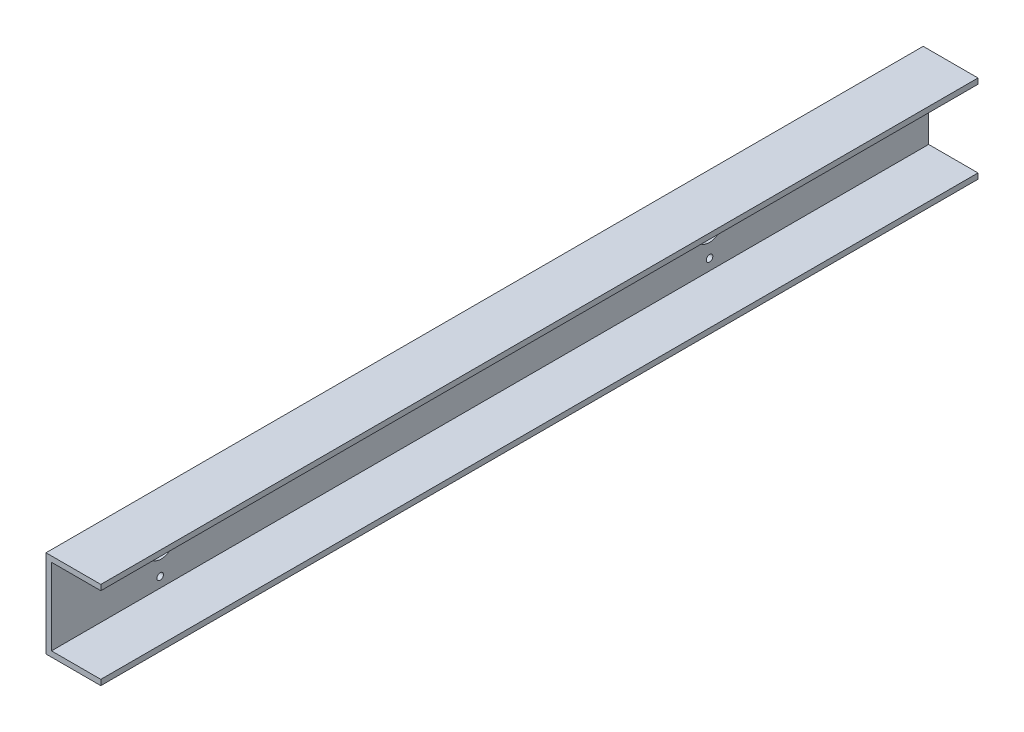
ISO-10303-21;
HEADER;
FILE_DESCRIPTION(('STEP AP214'),'2;1');
FILE_NAME('part.step','',(''),(''),'','','');
FILE_SCHEMA(('AUTOMOTIVE_DESIGN { 1 0 10303 214 1 1 1 1 }'));
ENDSEC;
DATA;
#1=APPLICATION_CONTEXT('core data for automotive mechanical design processes');
#2=APPLICATION_PROTOCOL_DEFINITION('international standard','automotive_design',2000,#1);
#3=PRODUCT_CONTEXT('',#1,'mechanical');
#4=PRODUCT('Part','Part','',(#3));
#5=PRODUCT_RELATED_PRODUCT_CATEGORY('part','',(#4));
#6=PRODUCT_DEFINITION_FORMATION('','',#4);
#7=PRODUCT_DEFINITION_CONTEXT('part definition',#1,'design');
#8=PRODUCT_DEFINITION('design','',#6,#7);
#9=PRODUCT_DEFINITION_SHAPE('','',#8);
#10=(LENGTH_UNIT() NAMED_UNIT(*) SI_UNIT(.MILLI.,.METRE.));
#11=(NAMED_UNIT(*) PLANE_ANGLE_UNIT() SI_UNIT($,.RADIAN.));
#12=(NAMED_UNIT(*) SI_UNIT($,.STERADIAN.) SOLID_ANGLE_UNIT());
#13=UNCERTAINTY_MEASURE_WITH_UNIT(LENGTH_MEASURE(1.E-05),#10,'distance_accuracy_value','');
#14=(GEOMETRIC_REPRESENTATION_CONTEXT(3) GLOBAL_UNCERTAINTY_ASSIGNED_CONTEXT((#13)) GLOBAL_UNIT_ASSIGNED_CONTEXT((#10,
#11,#12)) REPRESENTATION_CONTEXT('',''));
#15=CARTESIAN_POINT('',(0.,0.,0.));
#16=DIRECTION('',(0.,0.,1.));
#17=DIRECTION('',(1.,0.,0.));
#18=AXIS2_PLACEMENT_3D('',#15,#16,#17);
#19=CARTESIAN_POINT('',(23.8333333333334,37.5,400.));
#20=DIRECTION('',(-1.,0.,0.));
#21=DIRECTION('',(0.,0.,1.));
#22=AXIS2_PLACEMENT_3D('',#19,#20,#21);
#23=PLANE('',#22);
#24=DIRECTION('',(0.,1.,0.));
#25=VECTOR('',#24,1.);
#26=CARTESIAN_POINT('',(23.8333333333334,37.5,-400.));
#27=LINE('',#26,#25);
#28=CARTESIAN_POINT('',(23.8333333333334,37.5,-400.));
#29=VERTEX_POINT('',#28);
#30=CARTESIAN_POINT('',(23.8333333333334,42.5,-400.));
#31=VERTEX_POINT('',#30);
#32=EDGE_CURVE('E142',#29,#31,#27,.T.);
#33=ORIENTED_EDGE('',*,*,#32,.T.);
#34=DIRECTION('',(0.,0.,-1.));
#35=VECTOR('',#34,1.);
#36=CARTESIAN_POINT('',(23.8333333333334,42.5,400.));
#37=LINE('',#36,#35);
#38=CARTESIAN_POINT('',(23.8333333333334,42.5,400.));
#39=VERTEX_POINT('',#38);
#40=EDGE_CURVE('E11',#39,#31,#37,.T.);
#41=ORIENTED_EDGE('',*,*,#40,.F.);
#42=DIRECTION('',(0.,1.,0.));
#43=VECTOR('',#42,1.);
#44=CARTESIAN_POINT('',(23.8333333333334,37.5,400.));
#45=LINE('',#44,#43);
#46=CARTESIAN_POINT('',(23.8333333333334,37.5,400.));
#47=VERTEX_POINT('',#46);
#48=EDGE_CURVE('E165',#47,#39,#45,.T.);
#49=ORIENTED_EDGE('',*,*,#48,.F.);
#50=DIRECTION('',(0.,0.,-1.));
#51=VECTOR('',#50,1.);
#52=CARTESIAN_POINT('',(23.8333333333334,37.5,400.));
#53=LINE('',#52,#51);
#54=EDGE_CURVE('E138',#47,#29,#53,.T.);
#55=ORIENTED_EDGE('',*,*,#54,.T.);
#56=EDGE_LOOP('',(#33,#41,#49,#55));
#57=FACE_BOUND('',#56,.T.);
#58=ADVANCED_FACE('F39',(#57),#23,.F.);
#59=CARTESIAN_POINT('',(23.8333333333334,42.5,400.));
#60=DIRECTION('',(0.,-1.,0.));
#61=DIRECTION('',(1.,0.,0.));
#62=AXIS2_PLACEMENT_3D('',#59,#60,#61);
#63=PLANE('',#62);
#64=DIRECTION('',(-1.,0.,0.));
#65=VECTOR('',#64,1.);
#66=CARTESIAN_POINT('',(23.8333333333334,42.5,-400.));
#67=LINE('',#66,#65);
#68=CARTESIAN_POINT('',(-26.1666666666666,42.5,-400.));
#69=VERTEX_POINT('',#68);
#70=EDGE_CURVE('E146',#31,#69,#67,.T.);
#71=ORIENTED_EDGE('',*,*,#70,.T.);
#72=DIRECTION('',(0.,0.,-1.));
#73=VECTOR('',#72,1.);
#74=CARTESIAN_POINT('',(-26.1666666666666,42.5,400.));
#75=LINE('',#74,#73);
#76=CARTESIAN_POINT('',(-26.1666666666666,42.5,400.));
#77=VERTEX_POINT('',#76);
#78=EDGE_CURVE('E49',#77,#69,#75,.T.);
#79=ORIENTED_EDGE('',*,*,#78,.F.);
#80=DIRECTION('',(-1.,0.,0.));
#81=VECTOR('',#80,1.);
#82=CARTESIAN_POINT('',(23.8333333333334,42.5,400.));
#83=LINE('',#82,#81);
#84=EDGE_CURVE('E101',#39,#77,#83,.T.);
#85=ORIENTED_EDGE('',*,*,#84,.F.);
#86=ORIENTED_EDGE('',*,*,#40,.T.);
#87=EDGE_LOOP('',(#71,#79,#85,#86));
#88=FACE_BOUND('',#87,.T.);
#89=ADVANCED_FACE('F285',(#88),#63,.F.);
#90=CARTESIAN_POINT('',(-26.1666666666666,42.5,400.));
#91=DIRECTION('',(1.,0.,0.));
#92=DIRECTION('',(0.,1.,0.));
#93=AXIS2_PLACEMENT_3D('',#90,#91,#92);
#94=PLANE('',#93);
#95=CARTESIAN_POINT('',(-26.1666666666666,26.660043496681,299.206047637868));
#96=DIRECTION('',(1.,0.,0.));
#97=DIRECTION('',(0.,1.,0.));
#98=AXIS2_PLACEMENT_3D('',#95,#96,#97);
#99=CIRCLE('',#98,2.99999999999999);
#100=CARTESIAN_POINT('',(-26.1666666666666,29.660043496681,299.206047637868));
#101=VERTEX_POINT('',#100);
#102=EDGE_CURVE('E198',#101,#101,#99,.T.);
#103=ORIENTED_EDGE('',*,*,#102,.T.);
#104=EDGE_LOOP('',(#103));
#105=FACE_BOUND('',#104,.T.);
#106=CARTESIAN_POINT('',(-26.1666666666666,2.49464356867534,325.01367144014));
#107=DIRECTION('',(1.,0.,0.));
#108=DIRECTION('',(0.,1.,0.));
#109=AXIS2_PLACEMENT_3D('',#106,#107,#108);
#110=CIRCLE('',#109,2.99999999999999);
#111=CARTESIAN_POINT('',(-26.1666666666666,5.49464356867534,325.01367144014));
#112=VERTEX_POINT('',#111);
#113=EDGE_CURVE('E225',#112,#112,#110,.T.);
#114=ORIENTED_EDGE('',*,*,#113,.T.);
#115=EDGE_LOOP('',(#114));
#116=FACE_BOUND('',#115,.T.);
#117=CARTESIAN_POINT('',(-26.1666666666666,-23.3129802335956,300.848271512134));
#118=DIRECTION('',(1.,0.,0.));
#119=DIRECTION('',(0.,1.,0.));
#120=AXIS2_PLACEMENT_3D('',#117,#118,#119);
#121=CIRCLE('',#120,2.99999999999999);
#122=CARTESIAN_POINT('',(-26.1666666666666,-20.3129802335956,300.848271512134));
#123=VERTEX_POINT('',#122);
#124=EDGE_CURVE('E221',#123,#123,#121,.T.);
#125=ORIENTED_EDGE('',*,*,#124,.T.);
#126=EDGE_LOOP('',(#125));
#127=FACE_BOUND('',#126,.T.);
#128=CARTESIAN_POINT('',(-26.1666666666666,0.852419694410241,275.040647709863));
#129=DIRECTION('',(1.,0.,0.));
#130=DIRECTION('',(0.,1.,0.));
#131=AXIS2_PLACEMENT_3D('',#128,#129,#130);
#132=CIRCLE('',#131,2.99999999999999);
#133=CARTESIAN_POINT('',(-26.1666666666666,3.85241969441024,275.040647709863));
#134=VERTEX_POINT('',#133);
#135=EDGE_CURVE('E217',#134,#134,#132,.T.);
#136=ORIENTED_EDGE('',*,*,#135,.T.);
#137=EDGE_LOOP('',(#136));
#138=FACE_BOUND('',#137,.T.);
#139=CARTESIAN_POINT('',(-26.1666666666666,27.5,-200.158343399787));
#140=DIRECTION('',(1.,0.,0.));
#141=DIRECTION('',(0.,1.,0.));
#142=AXIS2_PLACEMENT_3D('',#139,#140,#141);
#143=CIRCLE('',#142,2.99999999999999);
#144=CARTESIAN_POINT('',(-26.1666666666666,30.5,-200.158343399787));
#145=VERTEX_POINT('',#144);
#146=EDGE_CURVE('E188',#145,#145,#143,.T.);
#147=ORIENTED_EDGE('',*,*,#146,.T.);
#148=EDGE_LOOP('',(#147));
#149=FACE_BOUND('',#148,.T.);
#150=CARTESIAN_POINT('',(-26.1666666666666,-22.5,-200.158343399787));
#151=DIRECTION('',(1.,0.,0.));
#152=DIRECTION('',(0.,1.,0.));
#153=AXIS2_PLACEMENT_3D('',#150,#151,#152);
#154=CIRCLE('',#153,2.99999999999999);
#155=CARTESIAN_POINT('',(-26.1666666666666,-19.5,-200.158343399787));
#156=VERTEX_POINT('',#155);
#157=EDGE_CURVE('E208',#156,#156,#154,.T.);
#158=ORIENTED_EDGE('',*,*,#157,.T.);
#159=EDGE_LOOP('',(#158));
#160=FACE_BOUND('',#159,.T.);
#161=CARTESIAN_POINT('',(-26.1666666666666,3.37817791663726,-175.));
#162=DIRECTION('',(1.,0.,0.));
#163=DIRECTION('',(0.,1.,0.));
#164=AXIS2_PLACEMENT_3D('',#161,#162,#163);
#165=CIRCLE('',#164,2.99999999999999);
#166=CARTESIAN_POINT('',(-26.1666666666666,6.37817791663725,-175.));
#167=VERTEX_POINT('',#166);
#168=EDGE_CURVE('E203',#167,#167,#165,.T.);
#169=ORIENTED_EDGE('',*,*,#168,.T.);
#170=EDGE_LOOP('',(#169));
#171=FACE_BOUND('',#170,.T.);
#172=CARTESIAN_POINT('',(-26.1666666666666,2.86375038361308,-224.997353573097));
#173=DIRECTION('',(1.,0.,0.));
#174=DIRECTION('',(0.,1.,0.));
#175=AXIS2_PLACEMENT_3D('',#172,#173,#174);
#176=CIRCLE('',#175,2.99999999999999);
#177=CARTESIAN_POINT('',(-26.1666666666666,5.86375038361307,-224.997353573097));
#178=VERTEX_POINT('',#177);
#179=EDGE_CURVE('E197',#178,#178,#176,.T.);
#180=ORIENTED_EDGE('',*,*,#179,.T.);
#181=EDGE_LOOP('',(#180));
#182=FACE_BOUND('',#181,.T.);
#183=CARTESIAN_POINT('',(-26.1666666666666,2.50000000000001,-200.));
#184=DIRECTION('',(1.,0.,0.));
#185=DIRECTION('',(0.,1.,0.));
#186=AXIS2_PLACEMENT_3D('',#183,#184,#185);
#187=CIRCLE('',#186,12.5);
#188=CARTESIAN_POINT('',(-26.1666666666666,15.,-200.));
#189=VERTEX_POINT('',#188);
#190=EDGE_CURVE('E147',#189,#189,#187,.T.);
#191=ORIENTED_EDGE('',*,*,#190,.T.);
#192=EDGE_LOOP('',(#191));
#193=FACE_BOUND('',#192,.T.);
#194=CARTESIAN_POINT('',(-26.1666666666666,2.50000000000001,300.));
#195=DIRECTION('',(1.,0.,0.));
#196=DIRECTION('',(0.,1.,0.));
#197=AXIS2_PLACEMENT_3D('',#194,#195,#196);
#198=CIRCLE('',#197,12.5);
#199=CARTESIAN_POINT('',(-26.1666666666666,15.,300.));
#200=VERTEX_POINT('',#199);
#201=EDGE_CURVE('E187',#200,#200,#198,.T.);
#202=ORIENTED_EDGE('',*,*,#201,.T.);
#203=EDGE_LOOP('',(#202));
#204=FACE_BOUND('',#203,.T.);
#205=DIRECTION('',(0.,-1.,0.));
#206=VECTOR('',#205,1.);
#207=CARTESIAN_POINT('',(-26.1666666666666,42.5,-400.));
#208=LINE('',#207,#206);
#209=CARTESIAN_POINT('',(-26.1666666666666,-37.5,-400.));
#210=VERTEX_POINT('',#209);
#211=EDGE_CURVE('E150',#69,#210,#208,.T.);
#212=ORIENTED_EDGE('',*,*,#211,.T.);
#213=DIRECTION('',(0.,0.,-1.));
#214=VECTOR('',#213,1.);
#215=CARTESIAN_POINT('',(-26.1666666666666,-37.5,400.));
#216=LINE('',#215,#214);
#217=CARTESIAN_POINT('',(-26.1666666666666,-37.5,400.));
#218=VERTEX_POINT('',#217);
#219=EDGE_CURVE('E176',#218,#210,#216,.T.);
#220=ORIENTED_EDGE('',*,*,#219,.F.);
#221=DIRECTION('',(0.,-1.,0.));
#222=VECTOR('',#221,1.);
#223=CARTESIAN_POINT('',(-26.1666666666666,42.5,400.));
#224=LINE('',#223,#222);
#225=EDGE_CURVE('E263',#77,#218,#224,.T.);
#226=ORIENTED_EDGE('',*,*,#225,.F.);
#227=ORIENTED_EDGE('',*,*,#78,.T.);
#228=EDGE_LOOP('',(#212,#220,#226,#227));
#229=FACE_BOUND('',#228,.T.);
#230=ADVANCED_FACE('F281',(#105,#116,#127,#138,#149,#160,#171,#182,#193,#204,#229),#94,.F.);
#231=CARTESIAN_POINT('',(-26.1666666666666,-37.5,400.));
#232=DIRECTION('',(0.,1.,0.));
#233=DIRECTION('',(0.,0.,1.));
#234=AXIS2_PLACEMENT_3D('',#231,#232,#233);
#235=PLANE('',#234);
#236=DIRECTION('',(1.,0.,0.));
#237=VECTOR('',#236,1.);
#238=CARTESIAN_POINT('',(-26.1666666666666,-37.5,-400.));
#239=LINE('',#238,#237);
#240=CARTESIAN_POINT('',(23.8333333333334,-37.5,-400.));
#241=VERTEX_POINT('',#240);
#242=EDGE_CURVE('E153',#210,#241,#239,.T.);
#243=ORIENTED_EDGE('',*,*,#242,.T.);
#244=DIRECTION('',(0.,0.,-1.));
#245=VECTOR('',#244,1.);
#246=CARTESIAN_POINT('',(23.8333333333334,-37.5,400.));
#247=LINE('',#246,#245);
#248=CARTESIAN_POINT('',(23.8333333333334,-37.5,400.));
#249=VERTEX_POINT('',#248);
#250=EDGE_CURVE('E172',#249,#241,#247,.T.);
#251=ORIENTED_EDGE('',*,*,#250,.F.);
#252=DIRECTION('',(1.,0.,0.));
#253=VECTOR('',#252,1.);
#254=CARTESIAN_POINT('',(-26.1666666666666,-37.5,400.));
#255=LINE('',#254,#253);
#256=EDGE_CURVE('E266',#218,#249,#255,.T.);
#257=ORIENTED_EDGE('',*,*,#256,.F.);
#258=ORIENTED_EDGE('',*,*,#219,.T.);
#259=EDGE_LOOP('',(#243,#251,#257,#258));
#260=FACE_BOUND('',#259,.T.);
#261=ADVANCED_FACE('F284',(#260),#235,.F.);
#262=CARTESIAN_POINT('',(23.8333333333334,-37.5,400.));
#263=DIRECTION('',(-1.,0.,0.));
#264=DIRECTION('',(0.,0.,1.));
#265=AXIS2_PLACEMENT_3D('',#262,#263,#264);
#266=PLANE('',#265);
#267=DIRECTION('',(0.,1.,0.));
#268=VECTOR('',#267,1.);
#269=CARTESIAN_POINT('',(23.8333333333334,-37.5,-400.));
#270=LINE('',#269,#268);
#271=CARTESIAN_POINT('',(23.8333333333334,-32.5,-400.));
#272=VERTEX_POINT('',#271);
#273=EDGE_CURVE('E156',#241,#272,#270,.T.);
#274=ORIENTED_EDGE('',*,*,#273,.T.);
#275=DIRECTION('',(0.,0.,-1.));
#276=VECTOR('',#275,1.);
#277=CARTESIAN_POINT('',(23.8333333333334,-32.5,400.));
#278=LINE('',#277,#276);
#279=CARTESIAN_POINT('',(23.8333333333334,-32.5,400.));
#280=VERTEX_POINT('',#279);
#281=EDGE_CURVE('E131',#280,#272,#278,.T.);
#282=ORIENTED_EDGE('',*,*,#281,.F.);
#283=DIRECTION('',(0.,1.,0.));
#284=VECTOR('',#283,1.);
#285=CARTESIAN_POINT('',(23.8333333333334,-37.5,400.));
#286=LINE('',#285,#284);
#287=EDGE_CURVE('E120',#249,#280,#286,.T.);
#288=ORIENTED_EDGE('',*,*,#287,.F.);
#289=ORIENTED_EDGE('',*,*,#250,.T.);
#290=EDGE_LOOP('',(#274,#282,#288,#289));
#291=FACE_BOUND('',#290,.T.);
#292=ADVANCED_FACE('F316',(#291),#266,.F.);
#293=CARTESIAN_POINT('',(23.8333333333334,-32.5,400.));
#294=DIRECTION('',(0.,-1.,0.));
#295=DIRECTION('',(1.,0.,0.));
#296=AXIS2_PLACEMENT_3D('',#293,#294,#295);
#297=PLANE('',#296);
#298=DIRECTION('',(-1.,0.,0.));
#299=VECTOR('',#298,1.);
#300=CARTESIAN_POINT('',(23.8333333333334,-32.5,-400.));
#301=LINE('',#300,#299);
#302=CARTESIAN_POINT('',(-21.1666666666666,-32.5,-400.));
#303=VERTEX_POINT('',#302);
#304=EDGE_CURVE('E129',#272,#303,#301,.T.);
#305=ORIENTED_EDGE('',*,*,#304,.T.);
#306=DIRECTION('',(0.,0.,-1.));
#307=VECTOR('',#306,1.);
#308=CARTESIAN_POINT('',(-21.1666666666666,-32.5,400.));
#309=LINE('',#308,#307);
#310=CARTESIAN_POINT('',(-21.1666666666666,-32.5,400.));
#311=VERTEX_POINT('',#310);
#312=EDGE_CURVE('E126',#311,#303,#309,.T.);
#313=ORIENTED_EDGE('',*,*,#312,.F.);
#314=DIRECTION('',(-1.,0.,0.));
#315=VECTOR('',#314,1.);
#316=CARTESIAN_POINT('',(23.8333333333334,-32.5,400.));
#317=LINE('',#316,#315);
#318=EDGE_CURVE('E114',#280,#311,#317,.T.);
#319=ORIENTED_EDGE('',*,*,#318,.F.);
#320=ORIENTED_EDGE('',*,*,#281,.T.);
#321=EDGE_LOOP('',(#305,#313,#319,#320));
#322=FACE_BOUND('',#321,.T.);
#323=ADVANCED_FACE('F127',(#322),#297,.F.);
#324=CARTESIAN_POINT('',(-21.1666666666666,-32.5,400.));
#325=DIRECTION('',(-1.,0.,0.));
#326=DIRECTION('',(0.,-1.,0.));
#327=AXIS2_PLACEMENT_3D('',#324,#325,#326);
#328=PLANE('',#327);
#329=CARTESIAN_POINT('',(-21.1666666666666,26.660043496681,299.206047637868));
#330=DIRECTION('',(-1.,0.,0.));
#331=DIRECTION('',(0.,-1.,0.));
#332=AXIS2_PLACEMENT_3D('',#329,#330,#331);
#333=CIRCLE('',#332,2.99999999999999);
#334=CARTESIAN_POINT('',(-21.1666666666666,23.660043496681,299.206047637868));
#335=VERTEX_POINT('',#334);
#336=EDGE_CURVE('E42',#335,#335,#333,.T.);
#337=ORIENTED_EDGE('',*,*,#336,.T.);
#338=EDGE_LOOP('',(#337));
#339=FACE_BOUND('',#338,.T.);
#340=CARTESIAN_POINT('',(-21.1666666666666,2.49464356867534,325.01367144014));
#341=DIRECTION('',(-1.,0.,0.));
#342=DIRECTION('',(0.,-1.,0.));
#343=AXIS2_PLACEMENT_3D('',#340,#341,#342);
#344=CIRCLE('',#343,2.99999999999999);
#345=CARTESIAN_POINT('',(-21.1666666666666,-0.50535643132465,325.01367144014));
#346=VERTEX_POINT('',#345);
#347=EDGE_CURVE('E222',#346,#346,#344,.T.);
#348=ORIENTED_EDGE('',*,*,#347,.T.);
#349=EDGE_LOOP('',(#348));
#350=FACE_BOUND('',#349,.T.);
#351=CARTESIAN_POINT('',(-21.1666666666666,-23.3129802335956,300.848271512134));
#352=DIRECTION('',(-1.,0.,0.));
#353=DIRECTION('',(0.,-1.,0.));
#354=AXIS2_PLACEMENT_3D('',#351,#352,#353);
#355=CIRCLE('',#354,2.99999999999999);
#356=CARTESIAN_POINT('',(-21.1666666666666,-26.3129802335956,300.848271512134));
#357=VERTEX_POINT('',#356);
#358=EDGE_CURVE('E218',#357,#357,#355,.T.);
#359=ORIENTED_EDGE('',*,*,#358,.T.);
#360=EDGE_LOOP('',(#359));
#361=FACE_BOUND('',#360,.T.);
#362=CARTESIAN_POINT('',(-21.1666666666666,0.852419694410241,275.040647709863));
#363=DIRECTION('',(-1.,0.,0.));
#364=DIRECTION('',(0.,-1.,0.));
#365=AXIS2_PLACEMENT_3D('',#362,#363,#364);
#366=CIRCLE('',#365,2.99999999999999);
#367=CARTESIAN_POINT('',(-21.1666666666666,-2.14758030558975,275.040647709863));
#368=VERTEX_POINT('',#367);
#369=EDGE_CURVE('E213',#368,#368,#366,.T.);
#370=ORIENTED_EDGE('',*,*,#369,.T.);
#371=EDGE_LOOP('',(#370));
#372=FACE_BOUND('',#371,.T.);
#373=CARTESIAN_POINT('',(-21.1666666666666,27.5,-200.158343399787));
#374=DIRECTION('',(-1.,0.,0.));
#375=DIRECTION('',(0.,-1.,0.));
#376=AXIS2_PLACEMENT_3D('',#373,#374,#375);
#377=CIRCLE('',#376,2.99999999999999);
#378=CARTESIAN_POINT('',(-21.1666666666666,24.5,-200.158343399787));
#379=VERTEX_POINT('',#378);
#380=EDGE_CURVE('E209',#379,#379,#377,.T.);
#381=ORIENTED_EDGE('',*,*,#380,.T.);
#382=EDGE_LOOP('',(#381));
#383=FACE_BOUND('',#382,.T.);
#384=CARTESIAN_POINT('',(-21.1666666666666,-22.5,-200.158343399787));
#385=DIRECTION('',(-1.,0.,0.));
#386=DIRECTION('',(0.,-1.,0.));
#387=AXIS2_PLACEMENT_3D('',#384,#385,#386);
#388=CIRCLE('',#387,2.99999999999999);
#389=CARTESIAN_POINT('',(-21.1666666666666,-25.5,-200.158343399787));
#390=VERTEX_POINT('',#389);
#391=EDGE_CURVE('E204',#390,#390,#388,.T.);
#392=ORIENTED_EDGE('',*,*,#391,.T.);
#393=EDGE_LOOP('',(#392));
#394=FACE_BOUND('',#393,.T.);
#395=CARTESIAN_POINT('',(-21.1666666666666,3.37817791663726,-175.));
#396=DIRECTION('',(-1.,0.,0.));
#397=DIRECTION('',(0.,-1.,0.));
#398=AXIS2_PLACEMENT_3D('',#395,#396,#397);
#399=CIRCLE('',#398,2.99999999999999);
#400=CARTESIAN_POINT('',(-21.1666666666666,0.378177916637261,-175.));
#401=VERTEX_POINT('',#400);
#402=EDGE_CURVE('E199',#401,#401,#399,.T.);
#403=ORIENTED_EDGE('',*,*,#402,.T.);
#404=EDGE_LOOP('',(#403));
#405=FACE_BOUND('',#404,.T.);
#406=CARTESIAN_POINT('',(-21.1666666666666,2.86375038361308,-224.997353573097));
#407=DIRECTION('',(-1.,0.,0.));
#408=DIRECTION('',(0.,-1.,0.));
#409=AXIS2_PLACEMENT_3D('',#406,#407,#408);
#410=CIRCLE('',#409,2.99999999999999);
#411=CARTESIAN_POINT('',(-21.1666666666666,-0.136249616386917,-224.997353573097));
#412=VERTEX_POINT('',#411);
#413=EDGE_CURVE('E193',#412,#412,#410,.T.);
#414=ORIENTED_EDGE('',*,*,#413,.T.);
#415=EDGE_LOOP('',(#414));
#416=FACE_BOUND('',#415,.T.);
#417=CARTESIAN_POINT('',(-21.1666666666666,2.50000000000001,-200.));
#418=DIRECTION('',(-1.,0.,0.));
#419=DIRECTION('',(0.,-1.,0.));
#420=AXIS2_PLACEMENT_3D('',#417,#418,#419);
#421=CIRCLE('',#420,12.5);
#422=CARTESIAN_POINT('',(-21.1666666666666,-10.,-200.));
#423=VERTEX_POINT('',#422);
#424=EDGE_CURVE('E189',#423,#423,#421,.T.);
#425=ORIENTED_EDGE('',*,*,#424,.T.);
#426=EDGE_LOOP('',(#425));
#427=FACE_BOUND('',#426,.T.);
#428=CARTESIAN_POINT('',(-21.1666666666666,2.50000000000001,300.));
#429=DIRECTION('',(-1.,0.,0.));
#430=DIRECTION('',(0.,-1.,0.));
#431=AXIS2_PLACEMENT_3D('',#428,#429,#430);
#432=CIRCLE('',#431,12.5);
#433=CARTESIAN_POINT('',(-21.1666666666666,-10.,300.));
#434=VERTEX_POINT('',#433);
#435=EDGE_CURVE('E183',#434,#434,#432,.T.);
#436=ORIENTED_EDGE('',*,*,#435,.T.);
#437=EDGE_LOOP('',(#436));
#438=FACE_BOUND('',#437,.T.);
#439=DIRECTION('',(0.,1.,0.));
#440=VECTOR('',#439,1.);
#441=CARTESIAN_POINT('',(-21.1666666666666,-32.5,-400.));
#442=LINE('',#441,#440);
#443=CARTESIAN_POINT('',(-21.1666666666666,37.5,-400.));
#444=VERTEX_POINT('',#443);
#445=EDGE_CURVE('E87',#303,#444,#442,.T.);
#446=ORIENTED_EDGE('',*,*,#445,.T.);
#447=DIRECTION('',(0.,0.,-1.));
#448=VECTOR('',#447,1.);
#449=CARTESIAN_POINT('',(-21.1666666666666,37.5,400.));
#450=LINE('',#449,#448);
#451=CARTESIAN_POINT('',(-21.1666666666666,37.5,400.));
#452=VERTEX_POINT('',#451);
#453=EDGE_CURVE('E132',#452,#444,#450,.T.);
#454=ORIENTED_EDGE('',*,*,#453,.F.);
#455=DIRECTION('',(0.,1.,0.));
#456=VECTOR('',#455,1.);
#457=CARTESIAN_POINT('',(-21.1666666666666,-32.5,400.));
#458=LINE('',#457,#456);
#459=EDGE_CURVE('E118',#311,#452,#458,.T.);
#460=ORIENTED_EDGE('',*,*,#459,.F.);
#461=ORIENTED_EDGE('',*,*,#312,.T.);
#462=EDGE_LOOP('',(#446,#454,#460,#461));
#463=FACE_BOUND('',#462,.T.);
#464=ADVANCED_FACE('F134',(#339,#350,#361,#372,#383,#394,#405,#416,#427,#438,#463),#328,.F.);
#465=CARTESIAN_POINT('',(-21.1666666666666,37.5,400.));
#466=DIRECTION('',(0.,1.,0.));
#467=DIRECTION('',(-1.,0.,0.));
#468=AXIS2_PLACEMENT_3D('',#465,#466,#467);
#469=PLANE('',#468);
#470=DIRECTION('',(1.,0.,0.));
#471=VECTOR('',#470,1.);
#472=CARTESIAN_POINT('',(-21.1666666666666,37.5,-400.));
#473=LINE('',#472,#471);
#474=EDGE_CURVE('E93',#444,#29,#473,.T.);
#475=ORIENTED_EDGE('',*,*,#474,.T.);
#476=ORIENTED_EDGE('',*,*,#54,.F.);
#477=DIRECTION('',(1.,0.,0.));
#478=VECTOR('',#477,1.);
#479=CARTESIAN_POINT('',(-21.1666666666666,37.5,400.));
#480=LINE('',#479,#478);
#481=EDGE_CURVE('E58',#452,#47,#480,.T.);
#482=ORIENTED_EDGE('',*,*,#481,.F.);
#483=ORIENTED_EDGE('',*,*,#453,.T.);
#484=EDGE_LOOP('',(#475,#476,#482,#483));
#485=FACE_BOUND('',#484,.T.);
#486=ADVANCED_FACE('F332',(#485),#469,.F.);
#487=CARTESIAN_POINT('',(0.,0.,400.));
#488=DIRECTION('',(0.,0.,1.));
#489=DIRECTION('',(1.,0.,0.));
#490=AXIS2_PLACEMENT_3D('',#487,#488,#489);
#491=PLANE('',#490);
#492=ORIENTED_EDGE('',*,*,#48,.T.);
#493=ORIENTED_EDGE('',*,*,#84,.T.);
#494=ORIENTED_EDGE('',*,*,#225,.T.);
#495=ORIENTED_EDGE('',*,*,#256,.T.);
#496=ORIENTED_EDGE('',*,*,#287,.T.);
#497=ORIENTED_EDGE('',*,*,#318,.T.);
#498=ORIENTED_EDGE('',*,*,#459,.T.);
#499=ORIENTED_EDGE('',*,*,#481,.T.);
#500=EDGE_LOOP('',(#492,#493,#494,#495,#496,#497,#498,#499));
#501=FACE_BOUND('',#500,.T.);
#502=ADVANCED_FACE('F116',(#501),#491,.T.);
#503=CARTESIAN_POINT('',(0.,0.,-400.));
#504=DIRECTION('',(0.,0.,1.));
#505=DIRECTION('',(1.,0.,0.));
#506=AXIS2_PLACEMENT_3D('',#503,#504,#505);
#507=PLANE('',#506);
#508=ORIENTED_EDGE('',*,*,#32,.F.);
#509=ORIENTED_EDGE('',*,*,#474,.F.);
#510=ORIENTED_EDGE('',*,*,#445,.F.);
#511=ORIENTED_EDGE('',*,*,#304,.F.);
#512=ORIENTED_EDGE('',*,*,#273,.F.);
#513=ORIENTED_EDGE('',*,*,#242,.F.);
#514=ORIENTED_EDGE('',*,*,#211,.F.);
#515=ORIENTED_EDGE('',*,*,#70,.F.);
#516=EDGE_LOOP('',(#508,#509,#510,#511,#512,#513,#514,#515));
#517=FACE_BOUND('',#516,.T.);
#518=ADVANCED_FACE('F314',(#517),#507,.F.);
#519=CARTESIAN_POINT('',(23.8333333333334,2.50000000000001,300.));
#520=DIRECTION('',(-1.,0.,0.));
#521=DIRECTION('',(0.,0.,1.));
#522=AXIS2_PLACEMENT_3D('',#519,#520,#521);
#523=CYLINDRICAL_SURFACE('',#522,12.5);
#524=ORIENTED_EDGE('',*,*,#435,.F.);
#525=EDGE_LOOP('',(#524));
#526=FACE_BOUND('',#525,.T.);
#527=ORIENTED_EDGE('',*,*,#201,.F.);
#528=EDGE_LOOP('',(#527));
#529=FACE_BOUND('',#528,.T.);
#530=ADVANCED_FACE('F343',(#526,#529),#523,.F.);
#531=CARTESIAN_POINT('',(23.8333333333334,2.50000000000001,-200.));
#532=DIRECTION('',(-1.,0.,0.));
#533=DIRECTION('',(0.,0.,1.));
#534=AXIS2_PLACEMENT_3D('',#531,#532,#533);
#535=CYLINDRICAL_SURFACE('',#534,12.5);
#536=ORIENTED_EDGE('',*,*,#424,.F.);
#537=EDGE_LOOP('',(#536));
#538=FACE_BOUND('',#537,.T.);
#539=ORIENTED_EDGE('',*,*,#190,.F.);
#540=EDGE_LOOP('',(#539));
#541=FACE_BOUND('',#540,.T.);
#542=ADVANCED_FACE('F347',(#538,#541),#535,.F.);
#543=CARTESIAN_POINT('',(23.8333333333334,2.86375038361308,-224.997353573097));
#544=DIRECTION('',(-1.,0.,0.));
#545=DIRECTION('',(0.,0.,1.));
#546=AXIS2_PLACEMENT_3D('',#543,#544,#545);
#547=CYLINDRICAL_SURFACE('',#546,2.99999999999999);
#548=ORIENTED_EDGE('',*,*,#413,.F.);
#549=EDGE_LOOP('',(#548));
#550=FACE_BOUND('',#549,.T.);
#551=ORIENTED_EDGE('',*,*,#179,.F.);
#552=EDGE_LOOP('',(#551));
#553=FACE_BOUND('',#552,.T.);
#554=ADVANCED_FACE('F351',(#550,#553),#547,.F.);
#555=CARTESIAN_POINT('',(23.8333333333334,3.37817791663726,-175.));
#556=DIRECTION('',(-1.,0.,0.));
#557=DIRECTION('',(0.,0.,1.));
#558=AXIS2_PLACEMENT_3D('',#555,#556,#557);
#559=CYLINDRICAL_SURFACE('',#558,2.99999999999999);
#560=ORIENTED_EDGE('',*,*,#402,.F.);
#561=EDGE_LOOP('',(#560));
#562=FACE_BOUND('',#561,.T.);
#563=ORIENTED_EDGE('',*,*,#168,.F.);
#564=EDGE_LOOP('',(#563));
#565=FACE_BOUND('',#564,.T.);
#566=ADVANCED_FACE('F355',(#562,#565),#559,.F.);
#567=CARTESIAN_POINT('',(23.8333333333334,-22.5,-200.158343399787));
#568=DIRECTION('',(-1.,0.,0.));
#569=DIRECTION('',(0.,0.,1.));
#570=AXIS2_PLACEMENT_3D('',#567,#568,#569);
#571=CYLINDRICAL_SURFACE('',#570,2.99999999999999);
#572=ORIENTED_EDGE('',*,*,#391,.F.);
#573=EDGE_LOOP('',(#572));
#574=FACE_BOUND('',#573,.T.);
#575=ORIENTED_EDGE('',*,*,#157,.F.);
#576=EDGE_LOOP('',(#575));
#577=FACE_BOUND('',#576,.T.);
#578=ADVANCED_FACE('F359',(#574,#577),#571,.F.);
#579=CARTESIAN_POINT('',(23.8333333333334,27.5,-200.158343399787));
#580=DIRECTION('',(-1.,0.,0.));
#581=DIRECTION('',(0.,0.,1.));
#582=AXIS2_PLACEMENT_3D('',#579,#580,#581);
#583=CYLINDRICAL_SURFACE('',#582,2.99999999999999);
#584=ORIENTED_EDGE('',*,*,#380,.F.);
#585=EDGE_LOOP('',(#584));
#586=FACE_BOUND('',#585,.T.);
#587=ORIENTED_EDGE('',*,*,#146,.F.);
#588=EDGE_LOOP('',(#587));
#589=FACE_BOUND('',#588,.T.);
#590=ADVANCED_FACE('F363',(#586,#589),#583,.F.);
#591=CARTESIAN_POINT('',(23.8333333333334,0.852419694410241,275.040647709863));
#592=DIRECTION('',(-1.,0.,0.));
#593=DIRECTION('',(0.,0.,1.));
#594=AXIS2_PLACEMENT_3D('',#591,#592,#593);
#595=CYLINDRICAL_SURFACE('',#594,2.99999999999999);
#596=ORIENTED_EDGE('',*,*,#369,.F.);
#597=EDGE_LOOP('',(#596));
#598=FACE_BOUND('',#597,.T.);
#599=ORIENTED_EDGE('',*,*,#135,.F.);
#600=EDGE_LOOP('',(#599));
#601=FACE_BOUND('',#600,.T.);
#602=ADVANCED_FACE('F367',(#598,#601),#595,.F.);
#603=CARTESIAN_POINT('',(23.8333333333334,-23.3129802335956,300.848271512134));
#604=DIRECTION('',(-1.,0.,0.));
#605=DIRECTION('',(0.,0.,1.));
#606=AXIS2_PLACEMENT_3D('',#603,#604,#605);
#607=CYLINDRICAL_SURFACE('',#606,2.99999999999999);
#608=ORIENTED_EDGE('',*,*,#358,.F.);
#609=EDGE_LOOP('',(#608));
#610=FACE_BOUND('',#609,.T.);
#611=ORIENTED_EDGE('',*,*,#124,.F.);
#612=EDGE_LOOP('',(#611));
#613=FACE_BOUND('',#612,.T.);
#614=ADVANCED_FACE('F371',(#610,#613),#607,.F.);
#615=CARTESIAN_POINT('',(23.8333333333334,2.49464356867534,325.01367144014));
#616=DIRECTION('',(-1.,0.,0.));
#617=DIRECTION('',(0.,0.,1.));
#618=AXIS2_PLACEMENT_3D('',#615,#616,#617);
#619=CYLINDRICAL_SURFACE('',#618,2.99999999999999);
#620=ORIENTED_EDGE('',*,*,#347,.F.);
#621=EDGE_LOOP('',(#620));
#622=FACE_BOUND('',#621,.T.);
#623=ORIENTED_EDGE('',*,*,#113,.F.);
#624=EDGE_LOOP('',(#623));
#625=FACE_BOUND('',#624,.T.);
#626=ADVANCED_FACE('F277',(#622,#625),#619,.F.);
#627=CARTESIAN_POINT('',(23.8333333333334,26.660043496681,299.206047637868));
#628=DIRECTION('',(-1.,0.,0.));
#629=DIRECTION('',(0.,0.,1.));
#630=AXIS2_PLACEMENT_3D('',#627,#628,#629);
#631=CYLINDRICAL_SURFACE('',#630,2.99999999999999);
#632=ORIENTED_EDGE('',*,*,#336,.F.);
#633=EDGE_LOOP('',(#632));
#634=FACE_BOUND('',#633,.T.);
#635=ORIENTED_EDGE('',*,*,#102,.F.);
#636=EDGE_LOOP('',(#635));
#637=FACE_BOUND('',#636,.T.);
#638=ADVANCED_FACE('F274',(#634,#637),#631,.F.);
#639=CLOSED_SHELL('',(#58,#89,#230,#261,#292,#323,#464,#486,#502,#518,#530,#542,#554,#566,#578,
#590,#602,#614,#626,#638));
#640=MANIFOLD_SOLID_BREP('B2',#639);
#641=ADVANCED_BREP_SHAPE_REPRESENTATION('',(#18,#640),#14);
#642=SHAPE_DEFINITION_REPRESENTATION(#9,#641);
ENDSEC;
END-ISO-10303-21;
